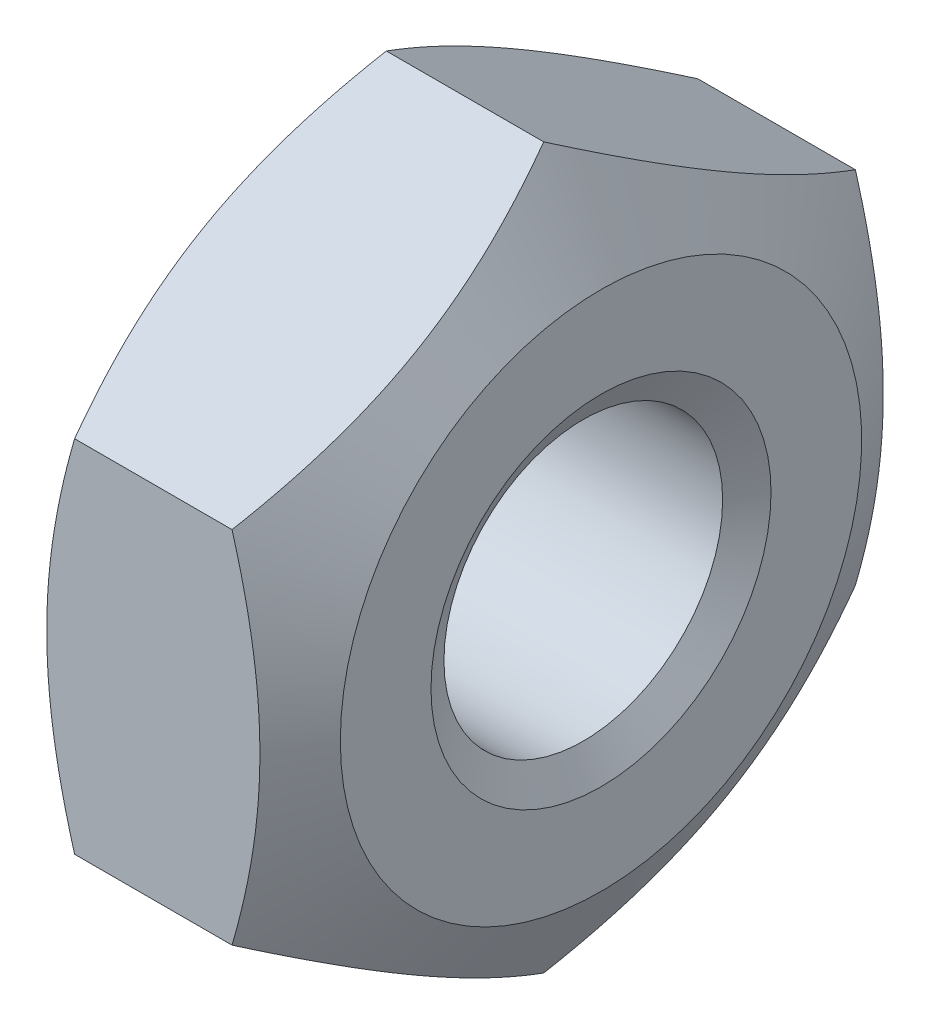
ISO-10303-21;
HEADER;
FILE_DESCRIPTION(('STEP AP214'),'2;1');
FILE_NAME('part.step','',(''),(''),'','','');
FILE_SCHEMA(('AUTOMOTIVE_DESIGN { 1 0 10303 214 1 1 1 1 }'));
ENDSEC;
DATA;
#1=APPLICATION_CONTEXT('core data for automotive mechanical design processes');
#2=APPLICATION_PROTOCOL_DEFINITION('international standard','automotive_design',2000,#1);
#3=PRODUCT_CONTEXT('',#1,'mechanical');
#4=PRODUCT('Part','Part','',(#3));
#5=PRODUCT_RELATED_PRODUCT_CATEGORY('part','',(#4));
#6=PRODUCT_DEFINITION_FORMATION('','',#4);
#7=PRODUCT_DEFINITION_CONTEXT('part definition',#1,'design');
#8=PRODUCT_DEFINITION('design','',#6,#7);
#9=PRODUCT_DEFINITION_SHAPE('','',#8);
#10=(LENGTH_UNIT() NAMED_UNIT(*) SI_UNIT(.MILLI.,.METRE.));
#11=(NAMED_UNIT(*) PLANE_ANGLE_UNIT() SI_UNIT($,.RADIAN.));
#12=(NAMED_UNIT(*) SI_UNIT($,.STERADIAN.) SOLID_ANGLE_UNIT());
#13=UNCERTAINTY_MEASURE_WITH_UNIT(LENGTH_MEASURE(1.E-05),#10,'distance_accuracy_value','');
#14=(GEOMETRIC_REPRESENTATION_CONTEXT(3) GLOBAL_UNCERTAINTY_ASSIGNED_CONTEXT((#13)) GLOBAL_UNIT_ASSIGNED_CONTEXT((#10,
#11,#12)) REPRESENTATION_CONTEXT('',''));
#15=CARTESIAN_POINT('',(0.,0.,0.));
#16=DIRECTION('',(0.,0.,1.));
#17=DIRECTION('',(1.,0.,0.));
#18=AXIS2_PLACEMENT_3D('',#15,#16,#17);
#19=CARTESIAN_POINT('',(0.,-1.58771324027147,-2.75000000000001));
#20=DIRECTION('',(0.,-0.866025403784438,-0.5));
#21=DIRECTION('',(0.,0.5,-0.866025403784438));
#22=AXIS2_PLACEMENT_3D('',#19,#20,#21);
#23=PLANE('',#22);
#24=CARTESIAN_POINT('',(1.89457227081406,-3.17542645956917,1.05677370736381E-08));
#25=CARTESIAN_POINT('',(1.93486590586192,-3.10565609170779,-0.120845841483615));
#26=CARTESIAN_POINT('',(1.97151085352844,-3.03528345852249,-0.242734829951547));
#27=CARTESIAN_POINT('',(2.0354735051396,-2.89331972966931,-0.488623230196292));
#28=CARTESIAN_POINT('',(2.06276858399163,-2.82172611238506,-0.612627009503181));
#29=CARTESIAN_POINT('',(2.10525534272448,-2.67942610375502,-0.859097852001737));
#30=CARTESIAN_POINT('',(2.12072982850071,-2.60874160090861,-0.981527003096313));
#31=CARTESIAN_POINT('',(2.13919968008389,-2.46704017425595,-1.22696107418617));
#32=CARTESIAN_POINT('',(2.14221034418956,-2.3960237651429,-1.34996510270803));
#33=CARTESIAN_POINT('',(2.13593113617861,-2.26333722314919,-1.57978493477586));
#34=CARTESIAN_POINT('',(2.12818301754884,-2.20164717955248,-1.6866352246561));
#35=CARTESIAN_POINT('',(2.10363099522736,-2.07866898287502,-1.89963970956128));
#36=CARTESIAN_POINT('',(2.08681871282409,-2.0173812548254,-2.00579316841064));
#37=CARTESIAN_POINT('',(2.04479126098825,-1.89414971139675,-2.21923646271352));
#38=CARTESIAN_POINT('',(2.01939802304476,-1.83222148476626,-2.32649929766287));
#39=CARTESIAN_POINT('',(1.96176610839163,-1.7092884238522,-2.53942560510136));
#40=CARTESIAN_POINT('',(1.92954096419356,-1.64828201586918,-2.64509180331791));
#41=CARTESIAN_POINT('',(1.8945722778935,-1.58771322661182,-2.75000002365922));
#42=B_SPLINE_CURVE_WITH_KNOTS('',3,(#24,#25,#26,#27,#28,#29,#30,#31,#32,#33,#34,#35,#36,#37,#38,
#39,#40,#41),.UNSPECIFIED.,.F.,.F.,(4,2,2,2,2,2,2,2,4),(0.,0.435897020207212,0.872841506597175,
1.29897296964876,1.72458123661091,2.09509821932502,2.46595828840692,2.84504225726385,
3.22338224444981),.UNSPECIFIED.);
#43=CARTESIAN_POINT('',(1.89457229259446,-3.17542646873979,2.04436595744794E-08));
#44=VERTEX_POINT('',#43);
#45=CARTESIAN_POINT('',(1.89457228097589,-1.58771323195066,-2.75000001441206));
#46=VERTEX_POINT('',#45);
#47=EDGE_CURVE('E174',#44,#46,#42,.T.);
#48=ORIENTED_EDGE('',*,*,#47,.F.);
#49=DIRECTION('',(1.,0.,0.));
#50=VECTOR('',#49,1.);
#51=CARTESIAN_POINT('',(0.,-3.17542648054294,0.));
#52=LINE('',#51,#50);
#53=CARTESIAN_POINT('',(0.505427707428921,-3.17542646874066,-2.0442152704221E-08));
#54=VERTEX_POINT('',#53);
#55=EDGE_CURVE('E85',#54,#44,#52,.T.);
#56=ORIENTED_EDGE('',*,*,#55,.F.);
#57=CARTESIAN_POINT('',(0.505427746507373,-1.58771319443364,-2.75000000441103));
#58=CARTESIAN_POINT('',(0.465134105039347,-1.65748359604145,-2.62915417201391));
#59=CARTESIAN_POINT('',(0.428489154182361,-1.72785624345342,-2.50726519094581));
#60=CARTESIAN_POINT('',(0.364526499117004,-1.86981998354074,-2.26137679473498));
#61=CARTESIAN_POINT('',(0.337231420003046,-1.94141359779052,-2.1373730120371));
#62=CARTESIAN_POINT('',(0.294744660121934,-2.08371360503,-1.89090216579758));
#63=CARTESIAN_POINT('',(0.279270173465292,-2.15439810940401,-1.76847301428399));
#64=CARTESIAN_POINT('',(0.260800320495573,-2.29609953795851,-1.52303894151777));
#65=CARTESIAN_POINT('',(0.257789655886369,-2.36711594744735,-1.40003491173938));
#66=CARTESIAN_POINT('',(0.264068862977007,-2.49980248732801,-1.17021508295227));
#67=CARTESIAN_POINT('',(0.271816980675713,-2.56149252839911,-1.06336479757543));
#68=CARTESIAN_POINT('',(0.296369000451132,-2.68447072000099,-0.850360321556576));
#69=CARTESIAN_POINT('',(0.313181281236138,-2.74575844550078,-0.744206867089759));
#70=CARTESIAN_POINT('',(0.355208729269278,-2.86898998384326,-0.530763581568637));
#71=CARTESIAN_POINT('',(0.380601965013055,-2.9309182079399,-0.423500751015073));
#72=CARTESIAN_POINT('',(0.438233874923238,-3.05385126389786,-0.210574452174787));
#73=CARTESIAN_POINT('',(0.470459016582293,-3.11485766945809,-0.104908258161618));
#74=CARTESIAN_POINT('',(0.505427700255913,-3.17542645631665,-4.19611834037509E-08));
#75=B_SPLINE_CURVE_WITH_KNOTS('',3,(#57,#58,#59,#60,#61,#62,#63,#64,#65,#66,#67,#68,#69,#70,#71,
#72,#73,#74),.UNSPECIFIED.,.F.,.F.,(4,2,2,2,2,2,2,2,4),(0.,0.435897024645075,0.87284151524282,
1.29897298200455,1.72458125277711,2.09509821991256,2.46595827329287,2.84504222592937,
3.22338219711898),.UNSPECIFIED.);
#76=CARTESIAN_POINT('',(0.505427701742238,-1.58771319696766,-2.75000000000001));
#77=VERTEX_POINT('',#76);
#78=EDGE_CURVE('E175',#77,#54,#75,.T.);
#79=ORIENTED_EDGE('',*,*,#78,.F.);
#80=DIRECTION('',(1.,0.,0.));
#81=VECTOR('',#80,1.);
#82=CARTESIAN_POINT('',(0.,-1.58771324027146,-2.75000000000001));
#83=LINE('',#82,#81);
#84=EDGE_CURVE('E239',#46,#77,#83,.F.);
#85=ORIENTED_EDGE('',*,*,#84,.F.);
#86=EDGE_LOOP('',(#48,#56,#79,#85));
#87=FACE_BOUND('',#86,.T.);
#88=ADVANCED_FACE('F16',(#87),#23,.T.);
#89=CARTESIAN_POINT('',(0.,1.58771324027148,-2.75));
#90=DIRECTION('',(0.,0.,-1.));
#91=DIRECTION('',(0.,1.,0.));
#92=AXIS2_PLACEMENT_3D('',#89,#90,#91);
#93=PLANE('',#92);
#94=CARTESIAN_POINT('',(1.89457231077747,-1.58771315366676,-2.74999999999533));
#95=CARTESIAN_POINT('',(1.93486593417748,-1.44817239238491,-2.74999999999832));
#96=CARTESIAN_POINT('',(1.97151087553416,-1.30742711723327,-2.74999999999955));
#97=CARTESIAN_POINT('',(2.03547351934646,-1.02349965675675,-2.75000000000046));
#98=CARTESIAN_POINT('',(2.06276859671432,-0.880312428233449,-2.75000000000012));
#99=CARTESIAN_POINT('',(2.10525535149713,-0.595712418688025,-2.74999999999989));
#100=CARTESIAN_POINT('',(2.12072983479956,-0.454343414752852,-2.74999999999997));
#101=CARTESIAN_POINT('',(2.13919968211498,-0.17094056622443,-2.75000000000003));
#102=CARTESIAN_POINT('',(2.14221034442968,-0.0289077510163266,-2.75000000000001));
#103=CARTESIAN_POINT('',(2.13593113378338,0.236465315872676,-2.75));
#104=CARTESIAN_POINT('',(2.1281830151578,0.35984538899155,-2.75));
#105=CARTESIAN_POINT('',(2.10363099496908,0.60580175431812,-2.75));
#106=CARTESIAN_POINT('',(2.08681871469655,0.728377196463695,-2.75));
#107=CARTESIAN_POINT('',(2.04479126899239,0.974840254890418,-2.75));
#108=CARTESIAN_POINT('',(2.01939803512674,1.09869669368938,-2.75));
#109=CARTESIAN_POINT('',(1.96176612998237,1.34456278704099,-2.75));
#110=CARTESIAN_POINT('',(1.92954099121112,1.46657558899145,-2.75));
#111=CARTESIAN_POINT('',(1.89457231077449,1.5877131536877,-2.75));
#112=B_SPLINE_CURVE_WITH_KNOTS('',3,(#94,#95,#96,#97,#98,#99,#100,#101,#102,#103,#104,#105,#106,
#107,#108,#109,#110,#111),.UNSPECIFIED.,.F.,.F.,(4,2,2,2,2,2,2,2,4),(0.,0.435897009963025,
0.872841486394547,1.29897294108089,1.72458119955819,2.09509814012049,2.46595816700245,
2.84504209095592,3.22338203340306),.UNSPECIFIED.);
#113=CARTESIAN_POINT('',(1.8945722982772,1.58771319697959,-2.75));
#114=VERTEX_POINT('',#113);
#115=EDGE_CURVE('E147',#46,#114,#112,.T.);
#116=ORIENTED_EDGE('',*,*,#115,.F.);
#117=ORIENTED_EDGE('',*,*,#84,.T.);
#118=CARTESIAN_POINT('',(0.505427746507018,1.58771326700975,-2.74999996250901));
#119=CARTESIAN_POINT('',(0.465134105042638,1.44817250542086,-2.74999998653492));
#120=CARTESIAN_POINT('',(0.428489154188651,1.30742722768107,-2.74999999639113));
#121=CARTESIAN_POINT('',(0.364526499127754,1.02349976005014,-2.75000000361754));
#122=CARTESIAN_POINT('',(0.337231420015147,0.880312526958087,-2.75000000095768));
#123=CARTESIAN_POINT('',(0.294744660129915,0.595712509204912,-2.74999999906603));
#124=CARTESIAN_POINT('',(0.279270173469983,0.454343501630694,-2.74999999975103));
#125=CARTESIAN_POINT('',(0.26080032049632,0.170940645355993,-2.75000000024867));
#126=CARTESIAN_POINT('',(0.257789655886568,0.0289078260406684,-2.75000000006236));
#127=CARTESIAN_POINT('',(0.264068862900329,-0.236465250713732,-2.74999999994572));
#128=CARTESIAN_POINT('',(0.271816980269895,-0.359845329570219,-2.74999999998537));
#129=CARTESIAN_POINT('',(0.296368998934198,-0.605801706342706,-2.75000000001465));
#130=CARTESIAN_POINT('',(0.313181278936156,-0.728377154196906,-2.75000000000423));
#131=CARTESIAN_POINT('',(0.355208725016804,-0.974840224496556,-2.74999999999569));
#132=CARTESIAN_POINT('',(0.380601959576994,-1.09869666945257,-2.74999999999785));
#133=CARTESIAN_POINT('',(0.43823386686259,-1.34456277501165,-2.75000000000216));
#134=CARTESIAN_POINT('',(0.470459007082211,-1.46657558301208,-2.7500000000043));
#135=CARTESIAN_POINT('',(0.505427689241566,-1.58771315366405,-2.75000000000001));
#136=B_SPLINE_CURVE_WITH_KNOTS('',3,(#118,#119,#120,#121,#122,#123,#124,#125,#126,#127,#128,
#129,#130,#131,#132,#133,#134,#135),.UNSPECIFIED.,.F.,.F.,(4,2,2,2,2,2,2,2,4),(0.,
0.435897024606381,0.872841515160476,1.2989729819614,1.72458125277676,2.09509821024748,
2.4659582539273,2.84504219635957,3.22338215742263),.UNSPECIFIED.);
#137=CARTESIAN_POINT('',(0.505427701742344,1.58771326192319,-2.74999996249812));
#138=VERTEX_POINT('',#137);
#139=EDGE_CURVE('E98',#138,#77,#136,.T.);
#140=ORIENTED_EDGE('',*,*,#139,.F.);
#141=DIRECTION('',(1.,0.,0.));
#142=VECTOR('',#141,1.);
#143=CARTESIAN_POINT('',(0.,1.58771324027147,-2.75));
#144=LINE('',#143,#142);
#145=EDGE_CURVE('E241',#114,#138,#144,.F.);
#146=ORIENTED_EDGE('',*,*,#145,.F.);
#147=EDGE_LOOP('',(#116,#117,#140,#146));
#148=FACE_BOUND('',#147,.T.);
#149=ADVANCED_FACE('F189',(#148),#93,.T.);
#150=CARTESIAN_POINT('',(0.,3.17542648054294,0.));
#151=DIRECTION('',(0.,0.866025403784439,-0.499999999999999));
#152=DIRECTION('',(0.,0.499999999999999,0.866025403784439));
#153=AXIS2_PLACEMENT_3D('',#150,#151,#152);
#154=PLANE('',#153);
#155=CARTESIAN_POINT('',(1.89457225351307,1.58771319442703,-2.75000000444026));
#156=CARTESIAN_POINT('',(1.93486589497535,1.65748359602424,-2.62915417205011));
#157=CARTESIAN_POINT('',(1.97151084582923,1.72785624342819,-2.50726519099121));
#158=CARTESIAN_POINT('',(2.03547350089163,1.86981998350092,-2.26137679480222));
#159=CARTESIAN_POINT('',(2.06276858000585,1.94141359774412,-2.137373012117));
#160=CARTESIAN_POINT('',(2.1052553398936,2.08371360498325,-1.89090216587898));
#161=CARTESIAN_POINT('',(2.12072982655448,2.15439810936368,-1.76847301435396));
#162=CARTESIAN_POINT('',(2.13919967952989,2.29609953793234,-1.52303894156297));
#163=CARTESIAN_POINT('',(2.14221034414046,2.36711594742893,-1.40003491177124));
#164=CARTESIAN_POINT('',(2.1359311371278,2.49980248570739,-1.17021508575928));
#165=CARTESIAN_POINT('',(2.12818301975828,2.56149252517198,-1.06336480316497));
#166=CARTESIAN_POINT('',(2.10363100109331,2.68447071358757,-0.850360332664929));
#167=CARTESIAN_POINT('',(2.08681872109064,2.74575843750764,-0.744206880934282));
#168=CARTESIAN_POINT('',(2.04479127500786,2.8689899726541,-0.530763600948822));
#169=CARTESIAN_POINT('',(2.01939804044624,2.93091819513601,-0.423500773192034));
#170=CARTESIAN_POINT('',(1.96176613315728,3.05385124792326,-0.2105744798436));
#171=CARTESIAN_POINT('',(1.92954099293573,3.11485765192727,-0.104908288525876));
#172=CARTESIAN_POINT('',(1.89457231077428,3.17542643725142,-7.49831167931624E-08));
#173=B_SPLINE_CURVE_WITH_KNOTS('',3,(#155,#156,#157,#158,#159,#160,#161,#162,#163,#164,#165,
#166,#167,#168,#169,#170,#171,#172),.UNSPECIFIED.,.F.,.F.,(4,2,2,2,2,2,2,2,4),(0.,
0.435897024608019,0.87284151516402,1.29897298196651,1.72458125278331,2.09509821026601,
2.46595825395791,2.845042196403,3.22338215747871),.UNSPECIFIED.);
#174=CARTESIAN_POINT('',(1.8945722982771,3.17542645889718,-3.74915576838543E-08));
#175=VERTEX_POINT('',#174);
#176=EDGE_CURVE('E128',#114,#175,#173,.T.);
#177=ORIENTED_EDGE('',*,*,#176,.F.);
#178=ORIENTED_EDGE('',*,*,#145,.T.);
#179=CARTESIAN_POINT('',(0.505427746504817,3.17542646146978,4.19166417552618E-08));
#180=CARTESIAN_POINT('',(0.465134105045911,3.10565610147363,-0.120845814491873));
#181=CARTESIAN_POINT('',(0.428489154193903,3.03528347113601,-0.242734805403521));
#182=CARTESIAN_POINT('',(0.36452649913376,2.8933197435765,-0.488623208815566));
#183=CARTESIAN_POINT('',(0.337231420019929,2.82172612472813,-0.612626988841034));
#184=CARTESIAN_POINT('',(0.294744660132919,2.6794261142143,-0.859097833186763));
#185=CARTESIAN_POINT('',(0.279270173472425,2.60874161102027,-0.981526985396068));
#186=CARTESIAN_POINT('',(0.260800320497352,2.46704018331388,-1.22696105868345));
#187=CARTESIAN_POINT('',(0.257789655886746,2.39602377349503,-1.34996508828837));
#188=CARTESIAN_POINT('',(0.264068862899024,2.26333723501577,-1.5797849141817));
#189=CARTESIAN_POINT('',(0.271816980268141,2.20164719562068,-1.6866351968142));
#190=CARTESIAN_POINT('',(0.296368998931926,2.07866900725742,-1.89963966734066));
#191=CARTESIAN_POINT('',(0.313181278933817,2.01738128332012,-2.00579311905949));
#192=CARTESIAN_POINT('',(0.355208725014677,1.89414974816054,-2.21923639903352));
#193=CARTESIAN_POINT('',(0.380601959575153,1.83222152568323,-2.32649922679097));
#194=CARTESIAN_POINT('',(0.43823386686159,1.70928847290512,-2.53942552014081));
#195=CARTESIAN_POINT('',(0.470459007081762,1.64828206890564,-2.64509171145928));
#196=CARTESIAN_POINT('',(0.505427689241766,1.58771328357483,-2.74999992499639));
#197=B_SPLINE_CURVE_WITH_KNOTS('',3,(#179,#180,#181,#182,#183,#184,#185,#186,#187,#188,#189,
#190,#191,#192,#193,#194,#195,#196),.UNSPECIFIED.,.F.,.F.,(4,2,2,2,2,2,2,2,4),(0.,
0.435897024605367,0.872841515158779,1.29897298195937,1.72458125277427,2.09509821025188,
2.46595825393869,2.84504219637802,3.223382157448),.UNSPECIFIED.);
#198=CARTESIAN_POINT('',(0.505427701745255,3.17542645889626,3.74931465495707E-08));
#199=VERTEX_POINT('',#198);
#200=EDGE_CURVE('E97',#199,#138,#197,.T.);
#201=ORIENTED_EDGE('',*,*,#200,.F.);
#202=DIRECTION('',(1.,0.,0.));
#203=VECTOR('',#202,1.);
#204=CARTESIAN_POINT('',(0.,3.17542648054294,0.));
#205=LINE('',#204,#203);
#206=EDGE_CURVE('E86',#175,#199,#205,.F.);
#207=ORIENTED_EDGE('',*,*,#206,.F.);
#208=EDGE_LOOP('',(#177,#178,#201,#207));
#209=FACE_BOUND('',#208,.T.);
#210=ADVANCED_FACE('F116',(#209),#154,.T.);
#211=CARTESIAN_POINT('',(0.,1.58771324027147,2.75));
#212=DIRECTION('',(0.,0.866025403784438,0.5));
#213=DIRECTION('',(0.,-0.5,0.866025403784438));
#214=AXIS2_PLACEMENT_3D('',#211,#212,#213);
#215=PLANE('',#214);
#216=CARTESIAN_POINT('',(1.89457225351341,3.17542646146595,-4.19218843117605E-08));
#217=CARTESIAN_POINT('',(1.93486589497558,3.10565610147309,0.120845814488547));
#218=CARTESIAN_POINT('',(1.97151084582941,3.03528347113661,0.242734805401338));
#219=CARTESIAN_POINT('',(2.03547350089174,2.89331974357748,0.488623208815009));
#220=CARTESIAN_POINT('',(2.06276858000595,2.82172612472835,0.61262698884096));
#221=CARTESIAN_POINT('',(2.10525533989367,2.67942611421358,0.859097833187729));
#222=CARTESIAN_POINT('',(2.12072982655453,2.60874161101935,0.981526985397582));
#223=CARTESIAN_POINT('',(2.13919967952991,2.46704018331243,1.22696105868605));
#224=CARTESIAN_POINT('',(2.14221034414046,2.39602377349324,1.34996508829149));
#225=CARTESIAN_POINT('',(2.13593113712778,2.26333723501292,1.57978491418661));
#226=CARTESIAN_POINT('',(2.12818301975828,2.20164719561712,1.68663519682036));
#227=CARTESIAN_POINT('',(2.10363100109337,2.07866900725245,1.89963966734927));
#228=CARTESIAN_POINT('',(2.08681872109074,2.01738128331446,2.0057931190693));
#229=CARTESIAN_POINT('',(2.04479127500809,1.89414974815344,2.21923639904582));
#230=CARTESIAN_POINT('',(2.01939804044655,1.83222152567538,2.32649922680456));
#231=CARTESIAN_POINT('',(1.96176613315776,1.70928847289583,2.5394255201569));
#232=CARTESIAN_POINT('',(1.92954099293631,1.64828206889566,2.64509171147657));
#233=CARTESIAN_POINT('',(1.89457231077496,1.58771328356417,2.74999992501484));
#234=B_SPLINE_CURVE_WITH_KNOTS('',3,(#216,#217,#218,#219,#220,#221,#222,#223,#224,#225,#226,
#227,#228,#229,#230,#231,#232,#233),.UNSPECIFIED.,.F.,.F.,(4,2,2,2,2,2,2,2,4),(0.,
0.435897024607928,0.872841515163842,1.29897298196626,1.72458125278299,2.09509821026499,
2.46595825395618,2.84504219640054,3.22338215747551),.UNSPECIFIED.);
#235=CARTESIAN_POINT('',(1.89457229827744,1.58771326191782,2.74999996250742));
#236=VERTEX_POINT('',#235);
#237=EDGE_CURVE('E121',#175,#236,#234,.T.);
#238=ORIENTED_EDGE('',*,*,#237,.F.);
#239=ORIENTED_EDGE('',*,*,#206,.T.);
#240=CARTESIAN_POINT('',(0.505427746507073,1.58771319443051,2.75000000444361));
#241=CARTESIAN_POINT('',(0.465134105047453,1.65748359602512,2.62915417205195));
#242=CARTESIAN_POINT('',(0.428489154195069,1.72785624342784,2.50726519099272));
#243=CARTESIAN_POINT('',(0.364526499134481,1.8698199834993,2.26137679480411));
#244=CARTESIAN_POINT('',(0.337231420020581,1.94141359774247,2.13737301211962));
#245=CARTESIAN_POINT('',(0.294744660133372,2.08371360498126,1.89090216588267));
#246=CARTESIAN_POINT('',(0.279270173472747,2.15439810936138,1.76847301435799));
#247=CARTESIAN_POINT('',(0.260800320497453,2.29609953792952,1.5230389415678));
#248=CARTESIAN_POINT('',(0.257789655886758,2.36711594742588,1.40003491177651));
#249=CARTESIAN_POINT('',(0.264068862898933,2.49980248570422,1.17021508576479));
#250=CARTESIAN_POINT('',(0.271816980268173,2.56149252516892,1.06336480317028));
#251=CARTESIAN_POINT('',(0.29636899893248,2.68447071358476,0.850360332669794));
#252=CARTESIAN_POINT('',(0.313181278934772,2.74575843750496,0.744206880938912));
#253=CARTESIAN_POINT('',(0.35520872501667,2.86898997265167,0.530763600953039));
#254=CARTESIAN_POINT('',(0.380601959577794,2.93091819513369,0.423500773196071));
#255=CARTESIAN_POINT('',(0.43823386686569,3.05385124792116,0.210574479847237));
#256=CARTESIAN_POINT('',(0.470459007086674,3.1148576519253,0.104908288529292));
#257=CARTESIAN_POINT('',(0.50542768924754,3.17542643724959,7.49862921480181E-08));
#258=B_SPLINE_CURVE_WITH_KNOTS('',3,(#240,#241,#242,#243,#244,#245,#246,#247,#248,#249,#250,
#251,#252,#253,#254,#255,#256,#257),.UNSPECIFIED.,.F.,.F.,(4,2,2,2,2,2,2,2,4),(0.,
0.435897024605965,0.872841515159955,1.29897298196101,1.72458125277636,2.09509821025971,
2.46595825395226,2.84504219639767,3.2233821574737),.UNSPECIFIED.);
#259=CARTESIAN_POINT('',(0.505427701744573,1.58771319697575,2.75));
#260=VERTEX_POINT('',#259);
#261=EDGE_CURVE('E92',#260,#199,#258,.T.);
#262=ORIENTED_EDGE('',*,*,#261,.F.);
#263=DIRECTION('',(1.,0.,0.));
#264=VECTOR('',#263,1.);
#265=CARTESIAN_POINT('',(0.,1.58771324027147,2.75));
#266=LINE('',#265,#264);
#267=EDGE_CURVE('E79',#236,#260,#266,.F.);
#268=ORIENTED_EDGE('',*,*,#267,.F.);
#269=EDGE_LOOP('',(#238,#239,#262,#268));
#270=FACE_BOUND('',#269,.T.);
#271=ADVANCED_FACE('F95',(#270),#215,.T.);
#272=CARTESIAN_POINT('',(0.,-1.58771324027147,2.75));
#273=DIRECTION('',(0.,0.,1.));
#274=DIRECTION('',(1.,0.,0.));
#275=AXIS2_PLACEMENT_3D('',#272,#273,#274);
#276=PLANE('',#275);
#277=CARTESIAN_POINT('',(1.89457225351229,1.58771326704062,2.74999996251716));
#278=CARTESIAN_POINT('',(1.93486589497481,1.44817250545067,2.74999998653784));
#279=CARTESIAN_POINT('',(1.97151084582882,1.30742722771025,2.74999999639192));
#280=CARTESIAN_POINT('',(2.03547350089138,1.02349976007831,2.75000000361675));
#281=CARTESIAN_POINT('',(2.06276858000562,0.88031252698588,2.75000000095747));
#282=CARTESIAN_POINT('',(2.10525533989345,0.595712509231829,2.74999999906623));
#283=CARTESIAN_POINT('',(2.12072982655436,0.454343501657121,2.74999999975109));
#284=CARTESIAN_POINT('',(2.13919967952986,0.170940645381406,2.75000000024861));
#285=CARTESIAN_POINT('',(2.14221034414046,0.0289078260655577,2.75000000006234));
#286=CARTESIAN_POINT('',(2.13593113712785,-0.236465250693283,2.74999999994573));
#287=CARTESIAN_POINT('',(2.12818301975837,-0.359845329553674,2.74999999998537));
#288=CARTESIAN_POINT('',(2.10363100109349,-0.605801706333927,2.75000000001464));
#289=CARTESIAN_POINT('',(2.08681872109086,-0.728377154191988,2.75000000000422));
#290=CARTESIAN_POINT('',(2.04479127500821,-0.974840224499473,2.74999999999568));
#291=CARTESIAN_POINT('',(2.01939804044665,-1.09869666945945,2.74999999999784));
#292=CARTESIAN_POINT('',(1.96176613315782,-1.34456277502625,2.75000000000215));
#293=CARTESIAN_POINT('',(1.92954099293634,-1.46657558303044,2.7500000000043));
#294=CARTESIAN_POINT('',(1.89457231077496,-1.58771315368608,2.75));
#295=B_SPLINE_CURVE_WITH_KNOTS('',3,(#277,#278,#279,#280,#281,#282,#283,#284,#285,#286,#287,
#288,#289,#290,#291,#292,#293,#294),.UNSPECIFIED.,.F.,.F.,(4,2,2,2,2,2,2,2,4),(0.,
0.435897024608217,0.872841515164408,1.29897298196706,1.72458125278404,2.09509821026637,
2.4659582539579,2.84504219640263,3.22338215747797),.UNSPECIFIED.);
#296=CARTESIAN_POINT('',(1.89457229827744,-1.58771319697878,2.75));
#297=VERTEX_POINT('',#296);
#298=EDGE_CURVE('E41',#236,#297,#295,.T.);
#299=ORIENTED_EDGE('',*,*,#298,.F.);
#300=ORIENTED_EDGE('',*,*,#267,.T.);
#301=CARTESIAN_POINT('',(0.505427689240765,-1.58771315366414,2.75000000000126));
#302=CARTESIAN_POINT('',(0.465134065844017,-1.4481723923823,2.75000000000045));
#303=CARTESIAN_POINT('',(0.428489124489153,-1.30742711723108,2.75000000000012));
#304=CARTESIAN_POINT('',(0.364526480679043,-1.02349965675576,2.74999999999988));
#305=CARTESIAN_POINT('',(0.33723140331155,-0.88031242823326,2.74999999999997));
#306=CARTESIAN_POINT('',(0.294744648529457,-0.595712418689208,2.75000000000003));
#307=CARTESIAN_POINT('',(0.279270165227393,-0.454343414754609,2.75000000000001));
#308=CARTESIAN_POINT('',(0.260800317912275,-0.170940566227397,2.74999999999999));
#309=CARTESIAN_POINT('',(0.257789655597531,-0.0289077510199273,2.75));
#310=CARTESIAN_POINT('',(0.264068866243448,0.23646531586815,2.75));
#311=CARTESIAN_POINT('',(0.271816984868762,0.359845388986729,2.75));
#312=CARTESIAN_POINT('',(0.296369005056758,0.605801754312753,2.75));
#313=CARTESIAN_POINT('',(0.313181285328826,0.728377196458079,2.75));
#314=CARTESIAN_POINT('',(0.3552087310319,0.974840254884214,2.75));
#315=CARTESIAN_POINT('',(0.380601964896896,1.09869669368284,2.75));
#316=CARTESIAN_POINT('',(0.438233870039863,1.34456278703384,2.75));
#317=CARTESIAN_POINT('',(0.47045900881035,1.46657558898403,2.75));
#318=CARTESIAN_POINT('',(0.505427689246177,1.58771315368004,2.75));
#319=B_SPLINE_CURVE_WITH_KNOTS('',3,(#301,#302,#303,#304,#305,#306,#307,#308,#309,#310,#311,
#312,#313,#314,#315,#316,#317,#318),.UNSPECIFIED.,.F.,.F.,(4,2,2,2,2,2,2,2,4),(0.,
0.435897009960479,0.872841486389515,1.29897294107402,1.72458119954947,2.09509814011084,
2.46595816699189,2.84504209094399,3.22338203338976),.UNSPECIFIED.);
#320=CARTESIAN_POINT('',(0.505427719046457,-1.58771323195159,2.75000001441046));
#321=VERTEX_POINT('',#320);
#322=EDGE_CURVE('E20',#321,#260,#319,.T.);
#323=ORIENTED_EDGE('',*,*,#322,.F.);
#324=DIRECTION('',(1.,0.,0.));
#325=VECTOR('',#324,1.);
#326=CARTESIAN_POINT('',(0.,-1.58771324027147,2.75));
#327=LINE('',#326,#325);
#328=EDGE_CURVE('E73',#297,#321,#327,.F.);
#329=ORIENTED_EDGE('',*,*,#328,.F.);
#330=EDGE_LOOP('',(#299,#300,#323,#329));
#331=FACE_BOUND('',#330,.T.);
#332=ADVANCED_FACE('F81',(#331),#276,.T.);
#333=CARTESIAN_POINT('',(0.,-3.17542648054294,0.));
#334=DIRECTION('',(0.,-0.866025403784439,0.5));
#335=DIRECTION('',(0.,-0.5,-0.866025403784439));
#336=AXIS2_PLACEMENT_3D('',#333,#334,#335);
#337=PLANE('',#336);
#338=CARTESIAN_POINT('',(1.8945722535123,-1.58771319442582,2.75000000444134));
#339=CARTESIAN_POINT('',(1.93486589497835,-1.65748359602951,2.62915417204062));
#340=CARTESIAN_POINT('',(1.9715108458353,-1.72785624343986,2.50726519097089));
#341=CARTESIAN_POINT('',(2.03547350090224,-1.86981998352625,2.26137679475844));
#342=CARTESIAN_POINT('',(2.06276858001782,-1.94141359777672,2.13737301206057));
#343=CARTESIAN_POINT('',(2.1052553399015,-2.08371360501698,1.89090216582054));
#344=CARTESIAN_POINT('',(2.12072982655911,-2.1543981093911,1.76847301430646));
#345=CARTESIAN_POINT('',(2.13919967953062,-2.29609953794599,1.52303894153933));
#346=CARTESIAN_POINT('',(2.14221034414066,-2.36711594743511,1.40003491176053));
#347=CARTESIAN_POINT('',(2.1359311370512,-2.4998024873169,1.17021508297152));
#348=CARTESIAN_POINT('',(2.1281830193528,-2.56149252838883,1.06336479759323));
#349=CARTESIAN_POINT('',(2.10363099957755,-2.68447071999238,0.850360321571471));
#350=CARTESIAN_POINT('',(2.08681871879241,-2.74575844549301,0.744206867103206));
#351=CARTESIAN_POINT('',(2.04479127075859,-2.86898998383719,0.530763581579138));
#352=CARTESIAN_POINT('',(2.01939803501425,-2.93091820793469,0.423500751024079));
#353=CARTESIAN_POINT('',(1.96176612510264,-3.05385126389432,0.210574452180915));
#354=CARTESIAN_POINT('',(1.92954098344271,-3.11485766945534,0.104908258166364));
#355=CARTESIAN_POINT('',(1.89457229976811,-3.17542645631467,4.19645950020382E-08));
#356=B_SPLINE_CURVE_WITH_KNOTS('',3,(#338,#339,#340,#341,#342,#343,#344,#345,#346,#347,#348,
#349,#350,#351,#352,#353,#354,#355),.UNSPECIFIED.,.F.,.F.,(4,2,2,2,2,2,2,2,4),(0.,
0.435897024646792,0.872841515246513,1.29897298200992,1.72458125278405,2.09509821992444,
2.46595827330975,2.84504222595164,3.22338219714652),.UNSPECIFIED.);
#357=EDGE_CURVE('E155',#297,#44,#356,.T.);
#358=ORIENTED_EDGE('',*,*,#357,.F.);
#359=ORIENTED_EDGE('',*,*,#328,.T.);
#360=CARTESIAN_POINT('',(0.505427729201818,-3.17542645957104,-1.0556992169839E-08));
#361=CARTESIAN_POINT('',(0.465134094157791,-3.1056560917058,0.120845841492065));
#362=CARTESIAN_POINT('',(0.428489146493419,-3.03528345851918,0.24273482995862));
#363=CARTESIAN_POINT('',(0.364526494884896,-2.89331972966558,0.488623230201393));
#364=CARTESIAN_POINT('',(0.337231416033354,-2.82172611238224,0.612627009507691));
#365=CARTESIAN_POINT('',(0.294744657301505,-2.67942610375336,0.859097852004954));
#366=CARTESIAN_POINT('',(0.279270171525797,-2.60874160090719,0.981527003098838));
#367=CARTESIAN_POINT('',(0.260800319943224,-2.46704017425522,1.22696107418732));
#368=CARTESIAN_POINT('',(0.257789655837631,-2.39602376514261,1.3499651027085));
#369=CARTESIAN_POINT('',(0.264068863848414,-2.26333722314941,1.57978493477547));
#370=CARTESIAN_POINT('',(0.271816982478033,-2.2016471795528,1.68663522465554));
#371=CARTESIAN_POINT('',(0.296369004799008,-2.07866898287552,1.89963970956039));
#372=CARTESIAN_POINT('',(0.313181287201938,-2.01738125482599,2.0057931684096));
#373=CARTESIAN_POINT('',(0.355208739036917,-1.89414971139755,2.21923646271211));
#374=CARTESIAN_POINT('',(0.380601976979879,-1.8322214847672,2.32649929766123));
#375=CARTESIAN_POINT('',(0.438233891631815,-1.70928842385337,2.53942560509933));
#376=CARTESIAN_POINT('',(0.470459035829234,-1.64828201587045,2.6450918033157));
#377=CARTESIAN_POINT('',(0.505427722128587,-1.58771322661318,2.75000002365685));
#378=B_SPLINE_CURVE_WITH_KNOTS('',3,(#360,#361,#362,#363,#364,#365,#366,#367,#368,#369,#370,
#371,#372,#373,#374,#375,#376,#377),.UNSPECIFIED.,.F.,.F.,(4,2,2,2,2,2,2,2,4),(0.,
0.435897020204083,0.87284150659099,1.29897296964023,1.72458123660001,2.09509821931348,
2.46595828839477,2.84504225725061,3.22338224443548),.UNSPECIFIED.);
#379=EDGE_CURVE('E94',#54,#321,#378,.T.);
#380=ORIENTED_EDGE('',*,*,#379,.F.);
#381=ORIENTED_EDGE('',*,*,#55,.T.);
#382=EDGE_LOOP('',(#358,#359,#380,#381));
#383=FACE_BOUND('',#382,.T.);
#384=ADVANCED_FACE('F164',(#383),#337,.T.);
#385=CARTESIAN_POINT('',(0.508460280457257,0.,0.));
#386=DIRECTION('',(1.,0.,0.));
#387=DIRECTION('',(0.,0.,-1.));
#388=AXIS2_PLACEMENT_3D('',#385,#386,#387);
#389=CONICAL_SURFACE('',#388,3.18067903930341,1.04719755119744);
#390=CARTESIAN_POINT('',(7.44308044017816E-11,0.,0.));
#391=DIRECTION('',(1.,0.,0.));
#392=DIRECTION('',(0.,0.,-1.));
#393=AXIS2_PLACEMENT_3D('',#390,#391,#392);
#394=CIRCLE('',#393,2.30000000004793);
#395=CARTESIAN_POINT('',(7.44308044017816E-11,0.,-2.30000000004793));
#396=VERTEX_POINT('',#395);
#397=EDGE_CURVE('E162',#396,#396,#394,.T.);
#398=ORIENTED_EDGE('',*,*,#397,.T.);
#399=EDGE_LOOP('',(#398));
#400=FACE_BOUND('',#399,.T.);
#401=ORIENTED_EDGE('',*,*,#78,.T.);
#402=ORIENTED_EDGE('',*,*,#379,.T.);
#403=ORIENTED_EDGE('',*,*,#322,.T.);
#404=ORIENTED_EDGE('',*,*,#261,.T.);
#405=ORIENTED_EDGE('',*,*,#200,.T.);
#406=ORIENTED_EDGE('',*,*,#139,.T.);
#407=EDGE_LOOP('',(#401,#402,#403,#404,#405,#406));
#408=FACE_BOUND('',#407,.T.);
#409=ADVANCED_FACE('F90',(#400,#408),#389,.T.);
#410=CARTESIAN_POINT('',(1.89153971956557,0.,0.));
#411=DIRECTION('',(-1.,0.,0.));
#412=DIRECTION('',(0.,0.,1.));
#413=AXIS2_PLACEMENT_3D('',#410,#411,#412);
#414=CONICAL_SURFACE('',#413,3.18067903930341,1.04719755118995);
#415=ORIENTED_EDGE('',*,*,#357,.T.);
#416=ORIENTED_EDGE('',*,*,#47,.T.);
#417=ORIENTED_EDGE('',*,*,#115,.T.);
#418=ORIENTED_EDGE('',*,*,#176,.T.);
#419=ORIENTED_EDGE('',*,*,#237,.T.);
#420=ORIENTED_EDGE('',*,*,#298,.T.);
#421=EDGE_LOOP('',(#415,#416,#417,#418,#419,#420));
#422=FACE_BOUND('',#421,.T.);
#423=CARTESIAN_POINT('',(2.39999999995719,0.,0.));
#424=DIRECTION('',(-1.,0.,0.));
#425=DIRECTION('',(0.,0.,1.));
#426=AXIS2_PLACEMENT_3D('',#423,#424,#425);
#427=CIRCLE('',#426,2.30000000004793);
#428=CARTESIAN_POINT('',(2.39999999995719,0.,2.30000000004793));
#429=VERTEX_POINT('',#428);
#430=EDGE_CURVE('E231',#429,#429,#427,.F.);
#431=ORIENTED_EDGE('',*,*,#430,.F.);
#432=EDGE_LOOP('',(#431));
#433=FACE_BOUND('',#432,.T.);
#434=ADVANCED_FACE('F139',(#422,#433),#414,.T.);
#435=CARTESIAN_POINT('',(0.,0.,0.));
#436=DIRECTION('',(1.,0.,0.));
#437=DIRECTION('',(0.,0.,-1.));
#438=AXIS2_PLACEMENT_3D('',#435,#436,#437);
#439=PLANE('',#438);
#440=CARTESIAN_POINT('',(0.,0.,0.));
#441=DIRECTION('',(-1.,0.,0.));
#442=DIRECTION('',(0.,0.,1.));
#443=AXIS2_PLACEMENT_3D('',#440,#441,#442);
#444=CIRCLE('',#443,1.50013293870188);
#445=CARTESIAN_POINT('',(0.,0.,1.50013293870188));
#446=VERTEX_POINT('',#445);
#447=EDGE_CURVE('E233',#446,#446,#444,.F.);
#448=ORIENTED_EDGE('',*,*,#447,.T.);
#449=EDGE_LOOP('',(#448));
#450=FACE_BOUND('',#449,.T.);
#451=ORIENTED_EDGE('',*,*,#397,.F.);
#452=EDGE_LOOP('',(#451));
#453=FACE_BOUND('',#452,.T.);
#454=ADVANCED_FACE('F143',(#450,#453),#439,.F.);
#455=CARTESIAN_POINT('',(2.4,0.,0.));
#456=DIRECTION('',(1.,0.,0.));
#457=DIRECTION('',(0.,0.,-1.));
#458=AXIS2_PLACEMENT_3D('',#455,#456,#457);
#459=PLANE('',#458);
#460=CARTESIAN_POINT('',(2.40000000002283,0.,0.));
#461=DIRECTION('',(1.,0.,0.));
#462=DIRECTION('',(0.,0.,-1.));
#463=AXIS2_PLACEMENT_3D('',#460,#461,#462);
#464=CIRCLE('',#463,1.50013293870188);
#465=CARTESIAN_POINT('',(2.40000000002283,0.,-1.50013293870188));
#466=VERTEX_POINT('',#465);
#467=EDGE_CURVE('E228',#466,#466,#464,.F.);
#468=ORIENTED_EDGE('',*,*,#467,.T.);
#469=EDGE_LOOP('',(#468));
#470=FACE_BOUND('',#469,.T.);
#471=ORIENTED_EDGE('',*,*,#430,.T.);
#472=EDGE_LOOP('',(#471));
#473=FACE_BOUND('',#472,.T.);
#474=ADVANCED_FACE('F217',(#470,#473),#459,.T.);
#475=CARTESIAN_POINT('',(0.,0.,0.));
#476=DIRECTION('',(-1.,0.,0.));
#477=DIRECTION('',(0.,0.,1.));
#478=AXIS2_PLACEMENT_3D('',#475,#476,#477);
#479=CONICAL_SURFACE('',#478,1.50013293870188,1.04719755126118);
#480=CARTESIAN_POINT('',(0.15625,0.,0.));
#481=DIRECTION('',(1.,0.,0.));
#482=DIRECTION('',(0.,0.,-1.));
#483=AXIS2_PLACEMENT_3D('',#480,#481,#482);
#484=CIRCLE('',#483,1.2295);
#485=CARTESIAN_POINT('',(0.15625,0.,-1.2295));
#486=VERTEX_POINT('',#485);
#487=EDGE_CURVE('E32',#486,#486,#484,.T.);
#488=ORIENTED_EDGE('',*,*,#487,.T.);
#489=EDGE_LOOP('',(#488));
#490=FACE_BOUND('',#489,.T.);
#491=ORIENTED_EDGE('',*,*,#447,.F.);
#492=EDGE_LOOP('',(#491));
#493=FACE_BOUND('',#492,.T.);
#494=ADVANCED_FACE('F210',(#490,#493),#479,.F.);
#495=CARTESIAN_POINT('',(2.40000000002283,0.,0.));
#496=DIRECTION('',(1.,0.,0.));
#497=DIRECTION('',(0.,0.,-1.));
#498=AXIS2_PLACEMENT_3D('',#495,#496,#497);
#499=CONICAL_SURFACE('',#498,1.50013293870188,1.0471975511946);
#500=CARTESIAN_POINT('',(2.24375,0.,0.));
#501=DIRECTION('',(1.,0.,0.));
#502=DIRECTION('',(0.,0.,-1.));
#503=AXIS2_PLACEMENT_3D('',#500,#501,#502);
#504=CIRCLE('',#503,1.2295);
#505=CARTESIAN_POINT('',(2.24375,0.,-1.2295));
#506=VERTEX_POINT('',#505);
#507=EDGE_CURVE('E11',#506,#506,#504,.F.);
#508=ORIENTED_EDGE('',*,*,#507,.T.);
#509=EDGE_LOOP('',(#508));
#510=FACE_BOUND('',#509,.T.);
#511=ORIENTED_EDGE('',*,*,#467,.F.);
#512=EDGE_LOOP('',(#511));
#513=FACE_BOUND('',#512,.T.);
#514=ADVANCED_FACE('F204',(#510,#513),#499,.F.);
#515=CARTESIAN_POINT('',(-6.33746721500764,0.,0.));
#516=DIRECTION('',(1.,0.,0.));
#517=DIRECTION('',(0.,0.,-1.));
#518=AXIS2_PLACEMENT_3D('',#515,#516,#517);
#519=CYLINDRICAL_SURFACE('',#518,1.2295);
#520=ORIENTED_EDGE('',*,*,#487,.F.);
#521=EDGE_LOOP('',(#520));
#522=FACE_BOUND('',#521,.T.);
#523=ORIENTED_EDGE('',*,*,#507,.F.);
#524=EDGE_LOOP('',(#523));
#525=FACE_BOUND('',#524,.T.);
#526=ADVANCED_FACE('F202',(#522,#525),#519,.F.);
#527=CLOSED_SHELL('',(#88,#149,#210,#271,#332,#384,#409,#434,#454,#474,#494,#514,#526));
#528=MANIFOLD_SOLID_BREP('B1',#527);
#529=ADVANCED_BREP_SHAPE_REPRESENTATION('',(#18,#528),#14);
#530=SHAPE_DEFINITION_REPRESENTATION(#9,#529);
ENDSEC;
END-ISO-10303-21;
